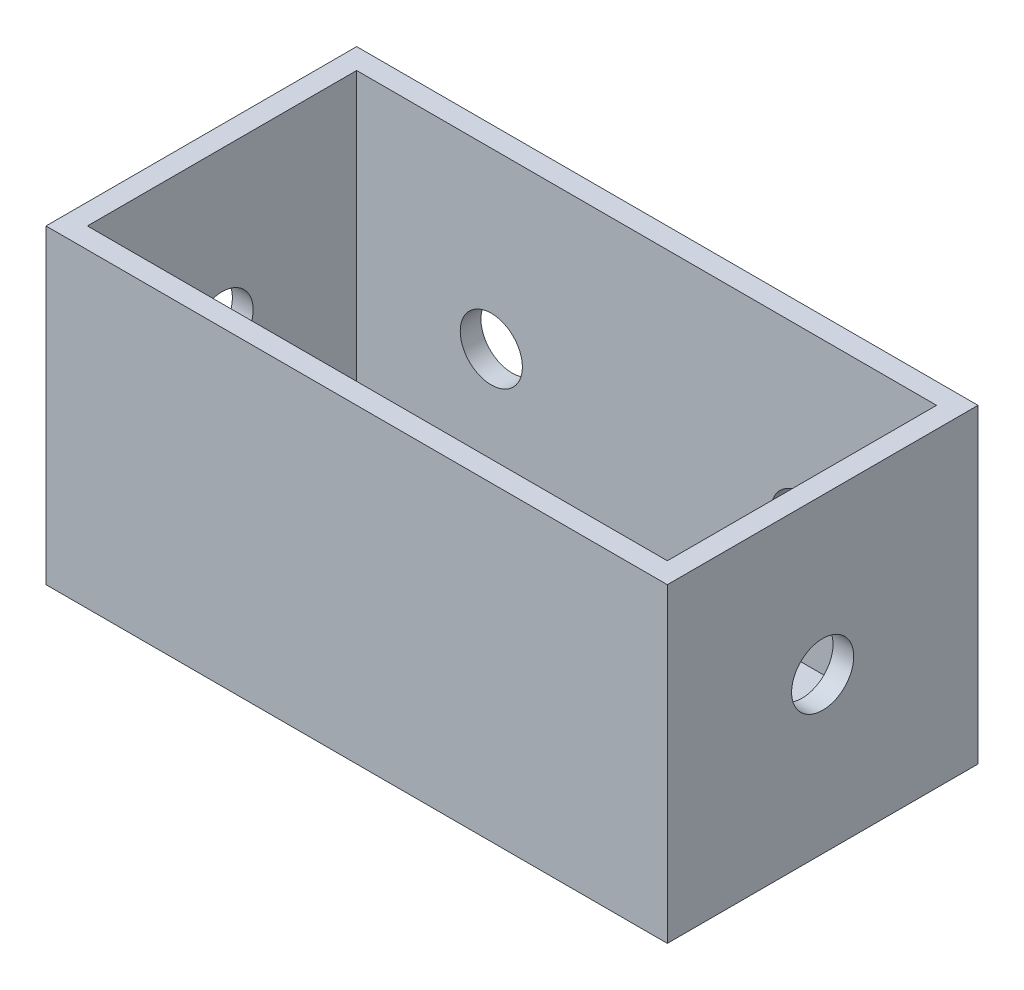
ISO-10303-21;
HEADER;
FILE_DESCRIPTION(('STEP AP214'),'2;1');
FILE_NAME('part.step','',(''),(''),'','','');
FILE_SCHEMA(('AUTOMOTIVE_DESIGN { 1 0 10303 214 1 1 1 1 }'));
ENDSEC;
DATA;
#1=APPLICATION_CONTEXT('core data for automotive mechanical design processes');
#2=APPLICATION_PROTOCOL_DEFINITION('international standard','automotive_design',2000,#1);
#3=PRODUCT_CONTEXT('',#1,'mechanical');
#4=PRODUCT('Part','Part','',(#3));
#5=PRODUCT_RELATED_PRODUCT_CATEGORY('part','',(#4));
#6=PRODUCT_DEFINITION_FORMATION('','',#4);
#7=PRODUCT_DEFINITION_CONTEXT('part definition',#1,'design');
#8=PRODUCT_DEFINITION('design','',#6,#7);
#9=PRODUCT_DEFINITION_SHAPE('','',#8);
#10=(LENGTH_UNIT() NAMED_UNIT(*) SI_UNIT(.MILLI.,.METRE.));
#11=(NAMED_UNIT(*) PLANE_ANGLE_UNIT() SI_UNIT($,.RADIAN.));
#12=(NAMED_UNIT(*) SI_UNIT($,.STERADIAN.) SOLID_ANGLE_UNIT());
#13=UNCERTAINTY_MEASURE_WITH_UNIT(LENGTH_MEASURE(1.E-05),#10,'distance_accuracy_value','');
#14=(GEOMETRIC_REPRESENTATION_CONTEXT(3) GLOBAL_UNCERTAINTY_ASSIGNED_CONTEXT((#13)) GLOBAL_UNIT_ASSIGNED_CONTEXT((#10,
#11,#12)) REPRESENTATION_CONTEXT('',''));
#15=CARTESIAN_POINT('',(0.,0.,0.));
#16=DIRECTION('',(0.,0.,1.));
#17=DIRECTION('',(1.,0.,0.));
#18=AXIS2_PLACEMENT_3D('',#15,#16,#17);
#19=CARTESIAN_POINT('',(15.,15.,7.5));
#20=DIRECTION('',(-1.,0.,0.));
#21=DIRECTION('',(0.,0.,1.));
#22=AXIS2_PLACEMENT_3D('',#19,#20,#21);
#23=PLANE('',#22);
#24=CARTESIAN_POINT('',(15.,7.5,0.));
#25=DIRECTION('',(1.,0.,0.));
#26=DIRECTION('',(0.,0.,-1.));
#27=AXIS2_PLACEMENT_3D('',#24,#25,#26);
#28=CIRCLE('',#27,1.5);
#29=CARTESIAN_POINT('',(15.,7.5,-1.5));
#30=VERTEX_POINT('',#29);
#31=EDGE_CURVE('E234',#30,#30,#28,.T.);
#32=ORIENTED_EDGE('',*,*,#31,.F.);
#33=EDGE_LOOP('',(#32));
#34=FACE_BOUND('',#33,.T.);
#35=DIRECTION('',(0.,0.,-1.));
#36=VECTOR('',#35,1.);
#37=CARTESIAN_POINT('',(15.,0.,7.5));
#38=LINE('',#37,#36);
#39=CARTESIAN_POINT('',(15.,0.,7.5));
#40=VERTEX_POINT('',#39);
#41=CARTESIAN_POINT('',(15.,0.,-7.5));
#42=VERTEX_POINT('',#41);
#43=EDGE_CURVE('E166',#40,#42,#38,.T.);
#44=ORIENTED_EDGE('',*,*,#43,.T.);
#45=DIRECTION('',(0.,-1.,0.));
#46=VECTOR('',#45,1.);
#47=CARTESIAN_POINT('',(15.,15.,-7.5));
#48=LINE('',#47,#46);
#49=CARTESIAN_POINT('',(15.,15.,-7.5));
#50=VERTEX_POINT('',#49);
#51=EDGE_CURVE('E11',#50,#42,#48,.T.);
#52=ORIENTED_EDGE('',*,*,#51,.F.);
#53=DIRECTION('',(0.,0.,-1.));
#54=VECTOR('',#53,1.);
#55=CARTESIAN_POINT('',(15.,15.,7.5));
#56=LINE('',#55,#54);
#57=CARTESIAN_POINT('',(15.,15.,7.5));
#58=VERTEX_POINT('',#57);
#59=EDGE_CURVE('E172',#58,#50,#56,.T.);
#60=ORIENTED_EDGE('',*,*,#59,.F.);
#61=DIRECTION('',(0.,-1.,0.));
#62=VECTOR('',#61,1.);
#63=CARTESIAN_POINT('',(15.,15.,7.5));
#64=LINE('',#63,#62);
#65=EDGE_CURVE('E182',#58,#40,#64,.T.);
#66=ORIENTED_EDGE('',*,*,#65,.T.);
#67=EDGE_LOOP('',(#44,#52,#60,#66));
#68=FACE_BOUND('',#67,.T.);
#69=ADVANCED_FACE('F43',(#34,#68),#23,.F.);
#70=CARTESIAN_POINT('',(-15.,15.,-7.5));
#71=DIRECTION('',(0.,0.,1.));
#72=DIRECTION('',(1.,0.,0.));
#73=AXIS2_PLACEMENT_3D('',#70,#71,#72);
#74=PLANE('',#73);
#75=CARTESIAN_POINT('',(7.5,6.60122484690106,-7.5));
#76=DIRECTION('',(0.,0.,-1.));
#77=DIRECTION('',(-1.,0.,0.));
#78=AXIS2_PLACEMENT_3D('',#75,#76,#77);
#79=CIRCLE('',#78,1.5);
#80=CARTESIAN_POINT('',(6.,6.60122484690106,-7.5));
#81=VERTEX_POINT('',#80);
#82=EDGE_CURVE('E244',#81,#81,#79,.T.);
#83=ORIENTED_EDGE('',*,*,#82,.F.);
#84=EDGE_LOOP('',(#83));
#85=FACE_BOUND('',#84,.T.);
#86=CARTESIAN_POINT('',(-7.5,6.60122484690106,-7.5));
#87=DIRECTION('',(0.,0.,-1.));
#88=DIRECTION('',(1.,0.,0.));
#89=AXIS2_PLACEMENT_3D('',#86,#87,#88);
#90=CIRCLE('',#89,1.5);
#91=CARTESIAN_POINT('',(-6.,6.60122484690106,-7.5));
#92=VERTEX_POINT('',#91);
#93=EDGE_CURVE('E247',#92,#92,#90,.T.);
#94=ORIENTED_EDGE('',*,*,#93,.F.);
#95=EDGE_LOOP('',(#94));
#96=FACE_BOUND('',#95,.T.);
#97=DIRECTION('',(-1.,0.,0.));
#98=VECTOR('',#97,1.);
#99=CARTESIAN_POINT('',(-15.,0.,-7.5));
#100=LINE('',#99,#98);
#101=CARTESIAN_POINT('',(-15.,0.,-7.5));
#102=VERTEX_POINT('',#101);
#103=EDGE_CURVE('E186',#42,#102,#100,.T.);
#104=ORIENTED_EDGE('',*,*,#103,.T.);
#105=DIRECTION('',(0.,-1.,0.));
#106=VECTOR('',#105,1.);
#107=CARTESIAN_POINT('',(-15.,15.,-7.5));
#108=LINE('',#107,#106);
#109=CARTESIAN_POINT('',(-15.,15.,-7.5));
#110=VERTEX_POINT('',#109);
#111=EDGE_CURVE('E52',#110,#102,#108,.T.);
#112=ORIENTED_EDGE('',*,*,#111,.F.);
#113=DIRECTION('',(-1.,0.,0.));
#114=VECTOR('',#113,1.);
#115=CARTESIAN_POINT('',(-15.,15.,-7.5));
#116=LINE('',#115,#114);
#117=EDGE_CURVE('E96',#50,#110,#116,.T.);
#118=ORIENTED_EDGE('',*,*,#117,.F.);
#119=ORIENTED_EDGE('',*,*,#51,.T.);
#120=EDGE_LOOP('',(#104,#112,#118,#119));
#121=FACE_BOUND('',#120,.T.);
#122=ADVANCED_FACE('F222',(#85,#96,#121),#74,.F.);
#123=CARTESIAN_POINT('',(-15.,15.,7.5));
#124=DIRECTION('',(1.,0.,0.));
#125=DIRECTION('',(0.,0.,-1.));
#126=AXIS2_PLACEMENT_3D('',#123,#124,#125);
#127=PLANE('',#126);
#128=CARTESIAN_POINT('',(-15.,7.5,0.));
#129=DIRECTION('',(1.,0.,0.));
#130=DIRECTION('',(0.,0.,-1.));
#131=AXIS2_PLACEMENT_3D('',#128,#129,#130);
#132=CIRCLE('',#131,1.5);
#133=CARTESIAN_POINT('',(-15.,7.5,-1.5));
#134=VERTEX_POINT('',#133);
#135=EDGE_CURVE('E237',#134,#134,#132,.T.);
#136=ORIENTED_EDGE('',*,*,#135,.T.);
#137=EDGE_LOOP('',(#136));
#138=FACE_BOUND('',#137,.T.);
#139=DIRECTION('',(0.,0.,1.));
#140=VECTOR('',#139,1.);
#141=CARTESIAN_POINT('',(-15.,0.,7.5));
#142=LINE('',#141,#140);
#143=CARTESIAN_POINT('',(-15.,0.,7.5));
#144=VERTEX_POINT('',#143);
#145=EDGE_CURVE('E189',#102,#144,#142,.T.);
#146=ORIENTED_EDGE('',*,*,#145,.T.);
#147=DIRECTION('',(0.,-1.,0.));
#148=VECTOR('',#147,1.);
#149=CARTESIAN_POINT('',(-15.,15.,7.5));
#150=LINE('',#149,#148);
#151=CARTESIAN_POINT('',(-15.,15.,7.5));
#152=VERTEX_POINT('',#151);
#153=EDGE_CURVE('E196',#152,#144,#150,.T.);
#154=ORIENTED_EDGE('',*,*,#153,.F.);
#155=DIRECTION('',(0.,0.,1.));
#156=VECTOR('',#155,1.);
#157=CARTESIAN_POINT('',(-15.,15.,7.5));
#158=LINE('',#157,#156);
#159=EDGE_CURVE('E177',#110,#152,#158,.T.);
#160=ORIENTED_EDGE('',*,*,#159,.F.);
#161=ORIENTED_EDGE('',*,*,#111,.T.);
#162=EDGE_LOOP('',(#146,#154,#160,#161));
#163=FACE_BOUND('',#162,.T.);
#164=ADVANCED_FACE('F204',(#138,#163),#127,.F.);
#165=CARTESIAN_POINT('',(-15.,15.,7.5));
#166=DIRECTION('',(0.,0.,-1.));
#167=DIRECTION('',(-1.,0.,0.));
#168=AXIS2_PLACEMENT_3D('',#165,#166,#167);
#169=PLANE('',#168);
#170=DIRECTION('',(1.,0.,0.));
#171=VECTOR('',#170,1.);
#172=CARTESIAN_POINT('',(-15.,0.,7.5));
#173=LINE('',#172,#171);
#174=EDGE_CURVE('E89',#144,#40,#173,.T.);
#175=ORIENTED_EDGE('',*,*,#174,.T.);
#176=ORIENTED_EDGE('',*,*,#65,.F.);
#177=DIRECTION('',(1.,0.,0.));
#178=VECTOR('',#177,1.);
#179=CARTESIAN_POINT('',(-15.,15.,7.5));
#180=LINE('',#179,#178);
#181=EDGE_CURVE('E68',#152,#58,#180,.T.);
#182=ORIENTED_EDGE('',*,*,#181,.F.);
#183=ORIENTED_EDGE('',*,*,#153,.T.);
#184=EDGE_LOOP('',(#175,#176,#182,#183));
#185=FACE_BOUND('',#184,.T.);
#186=ADVANCED_FACE('F212',(#185),#169,.F.);
#187=CARTESIAN_POINT('',(0.,15.,0.));
#188=DIRECTION('',(0.,-1.,0.));
#189=DIRECTION('',(0.,0.,-1.));
#190=AXIS2_PLACEMENT_3D('',#187,#188,#189);
#191=PLANE('',#190);
#192=DIRECTION('',(-1.,0.,0.));
#193=VECTOR('',#192,1.);
#194=CARTESIAN_POINT('',(-14.,15.,-6.5));
#195=LINE('',#194,#193);
#196=CARTESIAN_POINT('',(14.,15.,-6.5));
#197=VERTEX_POINT('',#196);
#198=CARTESIAN_POINT('',(-14.,15.,-6.5));
#199=VERTEX_POINT('',#198);
#200=EDGE_CURVE('E157',#197,#199,#195,.T.);
#201=ORIENTED_EDGE('',*,*,#200,.F.);
#202=DIRECTION('',(0.,0.,-1.));
#203=VECTOR('',#202,1.);
#204=CARTESIAN_POINT('',(14.,15.,6.5));
#205=LINE('',#204,#203);
#206=CARTESIAN_POINT('',(14.,15.,6.5));
#207=VERTEX_POINT('',#206);
#208=EDGE_CURVE('E59',#207,#197,#205,.T.);
#209=ORIENTED_EDGE('',*,*,#208,.F.);
#210=DIRECTION('',(1.,0.,0.));
#211=VECTOR('',#210,1.);
#212=CARTESIAN_POINT('',(-14.,15.,6.5));
#213=LINE('',#212,#211);
#214=CARTESIAN_POINT('',(-14.,15.,6.5));
#215=VERTEX_POINT('',#214);
#216=EDGE_CURVE('E141',#215,#207,#213,.T.);
#217=ORIENTED_EDGE('',*,*,#216,.F.);
#218=DIRECTION('',(0.,0.,1.));
#219=VECTOR('',#218,1.);
#220=CARTESIAN_POINT('',(-14.,15.,6.5));
#221=LINE('',#220,#219);
#222=EDGE_CURVE('E145',#199,#215,#221,.T.);
#223=ORIENTED_EDGE('',*,*,#222,.F.);
#224=EDGE_LOOP('',(#201,#209,#217,#223));
#225=FACE_BOUND('',#224,.T.);
#226=ORIENTED_EDGE('',*,*,#59,.T.);
#227=ORIENTED_EDGE('',*,*,#117,.T.);
#228=ORIENTED_EDGE('',*,*,#159,.T.);
#229=ORIENTED_EDGE('',*,*,#181,.T.);
#230=EDGE_LOOP('',(#226,#227,#228,#229));
#231=FACE_BOUND('',#230,.T.);
#232=ADVANCED_FACE('F214',(#225,#231),#191,.F.);
#233=CARTESIAN_POINT('',(0.,0.,0.));
#234=DIRECTION('',(0.,-1.,0.));
#235=DIRECTION('',(0.,0.,-1.));
#236=AXIS2_PLACEMENT_3D('',#233,#234,#235);
#237=PLANE('',#236);
#238=ORIENTED_EDGE('',*,*,#43,.F.);
#239=ORIENTED_EDGE('',*,*,#174,.F.);
#240=ORIENTED_EDGE('',*,*,#145,.F.);
#241=ORIENTED_EDGE('',*,*,#103,.F.);
#242=EDGE_LOOP('',(#238,#239,#240,#241));
#243=FACE_BOUND('',#242,.T.);
#244=ADVANCED_FACE('F208',(#243),#237,.T.);
#245=CARTESIAN_POINT('',(14.,0.999999999999999,6.5));
#246=DIRECTION('',(1.,0.,0.));
#247=DIRECTION('',(0.,0.,-1.));
#248=AXIS2_PLACEMENT_3D('',#245,#246,#247);
#249=PLANE('',#248);
#250=CARTESIAN_POINT('',(14.,7.5,0.));
#251=DIRECTION('',(1.,0.,0.));
#252=DIRECTION('',(0.,0.,-1.));
#253=AXIS2_PLACEMENT_3D('',#250,#251,#252);
#254=CIRCLE('',#253,1.5);
#255=CARTESIAN_POINT('',(14.,7.5,-1.5));
#256=VERTEX_POINT('',#255);
#257=EDGE_CURVE('E148',#256,#256,#254,.T.);
#258=ORIENTED_EDGE('',*,*,#257,.T.);
#259=EDGE_LOOP('',(#258));
#260=FACE_BOUND('',#259,.T.);
#261=ORIENTED_EDGE('',*,*,#208,.T.);
#262=DIRECTION('',(0.,1.,0.));
#263=VECTOR('',#262,1.);
#264=CARTESIAN_POINT('',(14.,0.999999999999999,-6.5));
#265=LINE('',#264,#263);
#266=CARTESIAN_POINT('',(14.,0.999999999999999,-6.5));
#267=VERTEX_POINT('',#266);
#268=EDGE_CURVE('E116',#267,#197,#265,.T.);
#269=ORIENTED_EDGE('',*,*,#268,.F.);
#270=DIRECTION('',(0.,0.,-1.));
#271=VECTOR('',#270,1.);
#272=CARTESIAN_POINT('',(14.,0.999999999999999,6.5));
#273=LINE('',#272,#271);
#274=CARTESIAN_POINT('',(14.,0.999999999999999,6.5));
#275=VERTEX_POINT('',#274);
#276=EDGE_CURVE('E120',#275,#267,#273,.T.);
#277=ORIENTED_EDGE('',*,*,#276,.F.);
#278=DIRECTION('',(0.,1.,0.));
#279=VECTOR('',#278,1.);
#280=CARTESIAN_POINT('',(14.,0.999999999999999,6.5));
#281=LINE('',#280,#279);
#282=EDGE_CURVE('E163',#275,#207,#281,.T.);
#283=ORIENTED_EDGE('',*,*,#282,.T.);
#284=EDGE_LOOP('',(#261,#269,#277,#283));
#285=FACE_BOUND('',#284,.T.);
#286=ADVANCED_FACE('F118',(#260,#285),#249,.F.);
#287=CARTESIAN_POINT('',(-14.,0.999999999999999,6.5));
#288=DIRECTION('',(0.,0.,1.));
#289=DIRECTION('',(1.,0.,0.));
#290=AXIS2_PLACEMENT_3D('',#287,#288,#289);
#291=PLANE('',#290);
#292=ORIENTED_EDGE('',*,*,#216,.T.);
#293=ORIENTED_EDGE('',*,*,#282,.F.);
#294=DIRECTION('',(1.,0.,0.));
#295=VECTOR('',#294,1.);
#296=CARTESIAN_POINT('',(-14.,0.999999999999999,6.5));
#297=LINE('',#296,#295);
#298=CARTESIAN_POINT('',(-14.,0.999999999999999,6.5));
#299=VERTEX_POINT('',#298);
#300=EDGE_CURVE('E127',#299,#275,#297,.T.);
#301=ORIENTED_EDGE('',*,*,#300,.F.);
#302=DIRECTION('',(0.,1.,0.));
#303=VECTOR('',#302,1.);
#304=CARTESIAN_POINT('',(-14.,0.999999999999999,6.5));
#305=LINE('',#304,#303);
#306=EDGE_CURVE('E167',#299,#215,#305,.T.);
#307=ORIENTED_EDGE('',*,*,#306,.T.);
#308=EDGE_LOOP('',(#292,#293,#301,#307));
#309=FACE_BOUND('',#308,.T.);
#310=ADVANCED_FACE('F279',(#309),#291,.F.);
#311=CARTESIAN_POINT('',(-14.,0.999999999999999,6.5));
#312=DIRECTION('',(-1.,0.,0.));
#313=DIRECTION('',(0.,0.,1.));
#314=AXIS2_PLACEMENT_3D('',#311,#312,#313);
#315=PLANE('',#314);
#316=CARTESIAN_POINT('',(-14.,7.5,0.));
#317=DIRECTION('',(-1.,0.,0.));
#318=DIRECTION('',(0.,0.,1.));
#319=AXIS2_PLACEMENT_3D('',#316,#317,#318);
#320=CIRCLE('',#319,1.5);
#321=CARTESIAN_POINT('',(-14.,7.5,1.5));
#322=VERTEX_POINT('',#321);
#323=EDGE_CURVE('E46',#322,#322,#320,.T.);
#324=ORIENTED_EDGE('',*,*,#323,.T.);
#325=EDGE_LOOP('',(#324));
#326=FACE_BOUND('',#325,.T.);
#327=ORIENTED_EDGE('',*,*,#222,.T.);
#328=ORIENTED_EDGE('',*,*,#306,.F.);
#329=DIRECTION('',(0.,0.,1.));
#330=VECTOR('',#329,1.);
#331=CARTESIAN_POINT('',(-14.,0.999999999999999,6.5));
#332=LINE('',#331,#330);
#333=CARTESIAN_POINT('',(-14.,0.999999999999999,-6.5));
#334=VERTEX_POINT('',#333);
#335=EDGE_CURVE('E136',#334,#299,#332,.T.);
#336=ORIENTED_EDGE('',*,*,#335,.F.);
#337=DIRECTION('',(0.,1.,0.));
#338=VECTOR('',#337,1.);
#339=CARTESIAN_POINT('',(-14.,0.999999999999999,-6.5));
#340=LINE('',#339,#338);
#341=EDGE_CURVE('E126',#334,#199,#340,.T.);
#342=ORIENTED_EDGE('',*,*,#341,.T.);
#343=EDGE_LOOP('',(#327,#328,#336,#342));
#344=FACE_BOUND('',#343,.T.);
#345=ADVANCED_FACE('F282',(#326,#344),#315,.F.);
#346=CARTESIAN_POINT('',(-14.,0.999999999999999,-6.5));
#347=DIRECTION('',(0.,0.,-1.));
#348=DIRECTION('',(-1.,0.,0.));
#349=AXIS2_PLACEMENT_3D('',#346,#347,#348);
#350=PLANE('',#349);
#351=CARTESIAN_POINT('',(7.5,6.60122484690106,-6.5));
#352=DIRECTION('',(0.,0.,-1.));
#353=DIRECTION('',(-1.,0.,0.));
#354=AXIS2_PLACEMENT_3D('',#351,#352,#353);
#355=CIRCLE('',#354,1.5);
#356=CARTESIAN_POINT('',(6.,6.60122484690106,-6.5));
#357=VERTEX_POINT('',#356);
#358=EDGE_CURVE('E238',#357,#357,#355,.F.);
#359=ORIENTED_EDGE('',*,*,#358,.F.);
#360=EDGE_LOOP('',(#359));
#361=FACE_BOUND('',#360,.T.);
#362=CARTESIAN_POINT('',(-7.5,6.60122484690106,-6.5));
#363=DIRECTION('',(0.,0.,-1.));
#364=DIRECTION('',(-1.,0.,0.));
#365=AXIS2_PLACEMENT_3D('',#362,#363,#364);
#366=CIRCLE('',#365,1.5);
#367=CARTESIAN_POINT('',(-9.,6.60122484690106,-6.5));
#368=VERTEX_POINT('',#367);
#369=EDGE_CURVE('E251',#368,#368,#366,.F.);
#370=ORIENTED_EDGE('',*,*,#369,.F.);
#371=EDGE_LOOP('',(#370));
#372=FACE_BOUND('',#371,.T.);
#373=ORIENTED_EDGE('',*,*,#200,.T.);
#374=ORIENTED_EDGE('',*,*,#341,.F.);
#375=DIRECTION('',(-1.,0.,0.));
#376=VECTOR('',#375,1.);
#377=CARTESIAN_POINT('',(-14.,0.999999999999999,-6.5));
#378=LINE('',#377,#376);
#379=EDGE_CURVE('E130',#267,#334,#378,.T.);
#380=ORIENTED_EDGE('',*,*,#379,.F.);
#381=ORIENTED_EDGE('',*,*,#268,.T.);
#382=EDGE_LOOP('',(#373,#374,#380,#381));
#383=FACE_BOUND('',#382,.T.);
#384=ADVANCED_FACE('F131',(#361,#372,#383),#350,.F.);
#385=CARTESIAN_POINT('',(0.,0.999999999999999,0.));
#386=DIRECTION('',(0.,-1.,0.));
#387=DIRECTION('',(0.,0.,-1.));
#388=AXIS2_PLACEMENT_3D('',#385,#386,#387);
#389=PLANE('',#388);
#390=ORIENTED_EDGE('',*,*,#276,.T.);
#391=ORIENTED_EDGE('',*,*,#379,.T.);
#392=ORIENTED_EDGE('',*,*,#335,.T.);
#393=ORIENTED_EDGE('',*,*,#300,.T.);
#394=EDGE_LOOP('',(#390,#391,#392,#393));
#395=FACE_BOUND('',#394,.T.);
#396=ADVANCED_FACE('F138',(#395),#389,.F.);
#397=CARTESIAN_POINT('',(-15.,7.5,0.));
#398=DIRECTION('',(1.,0.,0.));
#399=DIRECTION('',(0.,0.,-1.));
#400=AXIS2_PLACEMENT_3D('',#397,#398,#399);
#401=CYLINDRICAL_SURFACE('',#400,1.5);
#402=ORIENTED_EDGE('',*,*,#135,.F.);
#403=EDGE_LOOP('',(#402));
#404=FACE_BOUND('',#403,.T.);
#405=ORIENTED_EDGE('',*,*,#323,.F.);
#406=EDGE_LOOP('',(#405));
#407=FACE_BOUND('',#406,.T.);
#408=ADVANCED_FACE('F274',(#404,#407),#401,.F.);
#409=ORIENTED_EDGE('',*,*,#31,.T.);
#410=EDGE_LOOP('',(#409));
#411=FACE_BOUND('',#410,.T.);
#412=ORIENTED_EDGE('',*,*,#257,.F.);
#413=EDGE_LOOP('',(#412));
#414=FACE_BOUND('',#413,.T.);
#415=ADVANCED_FACE('F265',(#411,#414),#401,.F.);
#416=CARTESIAN_POINT('',(-7.5,6.60122484690106,-2.25735931288071));
#417=DIRECTION('',(0.,0.,-1.));
#418=DIRECTION('',(-1.,0.,0.));
#419=AXIS2_PLACEMENT_3D('',#416,#417,#418);
#420=CYLINDRICAL_SURFACE('',#419,1.5);
#421=ORIENTED_EDGE('',*,*,#369,.T.);
#422=EDGE_LOOP('',(#421));
#423=FACE_BOUND('',#422,.T.);
#424=ORIENTED_EDGE('',*,*,#93,.T.);
#425=EDGE_LOOP('',(#424));
#426=FACE_BOUND('',#425,.T.);
#427=ADVANCED_FACE('F263',(#423,#426),#420,.F.);
#428=CARTESIAN_POINT('',(7.5,6.60122484690106,-2.25735931288071));
#429=DIRECTION('',(0.,0.,-1.));
#430=DIRECTION('',(-1.,0.,0.));
#431=AXIS2_PLACEMENT_3D('',#428,#429,#430);
#432=CYLINDRICAL_SURFACE('',#431,1.5);
#433=ORIENTED_EDGE('',*,*,#358,.T.);
#434=EDGE_LOOP('',(#433));
#435=FACE_BOUND('',#434,.T.);
#436=ORIENTED_EDGE('',*,*,#82,.T.);
#437=EDGE_LOOP('',(#436));
#438=FACE_BOUND('',#437,.T.);
#439=ADVANCED_FACE('F259',(#435,#438),#432,.F.);
#440=CLOSED_SHELL('',(#69,#122,#164,#186,#232,#244,#286,#310,#345,#384,#396,#408,#415,#427,#439));
#441=MANIFOLD_SOLID_BREP('B2',#440);
#442=ADVANCED_BREP_SHAPE_REPRESENTATION('',(#18,#441),#14);
#443=SHAPE_DEFINITION_REPRESENTATION(#9,#442);
ENDSEC;
END-ISO-10303-21;
